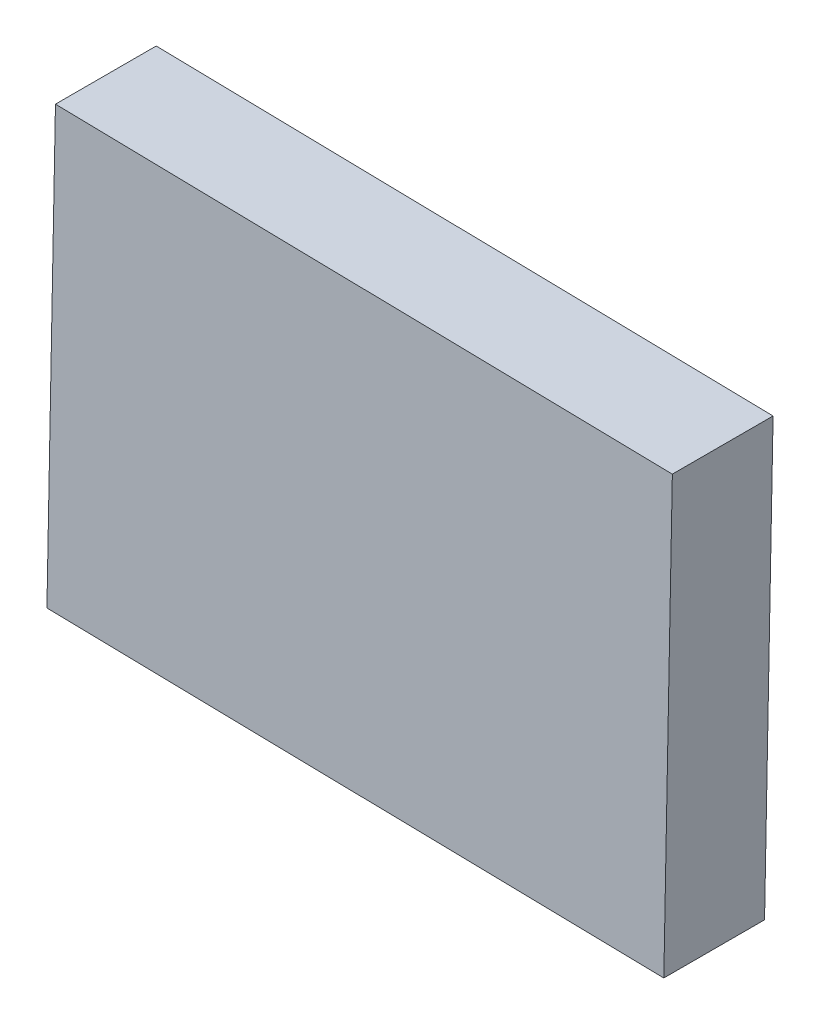
ISO-10303-21;
HEADER;
FILE_DESCRIPTION(('STEP AP214'),'2;1');
FILE_NAME('part.step','',(''),(''),'','','');
FILE_SCHEMA(('AUTOMOTIVE_DESIGN { 1 0 10303 214 1 1 1 1 }'));
ENDSEC;
DATA;
#1=APPLICATION_CONTEXT('core data for automotive mechanical design processes');
#2=APPLICATION_PROTOCOL_DEFINITION('international standard','automotive_design',2000,#1);
#3=PRODUCT_CONTEXT('',#1,'mechanical');
#4=PRODUCT('Part','Part','',(#3));
#5=PRODUCT_RELATED_PRODUCT_CATEGORY('part','',(#4));
#6=PRODUCT_DEFINITION_FORMATION('','',#4);
#7=PRODUCT_DEFINITION_CONTEXT('part definition',#1,'design');
#8=PRODUCT_DEFINITION('design','',#6,#7);
#9=PRODUCT_DEFINITION_SHAPE('','',#8);
#10=(LENGTH_UNIT() NAMED_UNIT(*) SI_UNIT(.MILLI.,.METRE.));
#11=(NAMED_UNIT(*) PLANE_ANGLE_UNIT() SI_UNIT($,.RADIAN.));
#12=(NAMED_UNIT(*) SI_UNIT($,.STERADIAN.) SOLID_ANGLE_UNIT());
#13=UNCERTAINTY_MEASURE_WITH_UNIT(LENGTH_MEASURE(1.E-05),#10,'distance_accuracy_value','');
#14=(GEOMETRIC_REPRESENTATION_CONTEXT(3) GLOBAL_UNCERTAINTY_ASSIGNED_CONTEXT((#13)) GLOBAL_UNIT_ASSIGNED_CONTEXT((#10,
#11,#12)) REPRESENTATION_CONTEXT('',''));
#15=CARTESIAN_POINT('',(0.,0.,0.));
#16=DIRECTION('',(0.,0.,1.));
#17=DIRECTION('',(1.,0.,0.));
#18=AXIS2_PLACEMENT_3D('',#15,#16,#17);
#19=CARTESIAN_POINT('',(-1.71669371262008,0.557184606220066,38.2500965279299));
#20=DIRECTION('',(0.,0.,-1.));
#21=DIRECTION('',(-0.0193548335692301,-0.999812677663925,0.));
#22=AXIS2_PLACEMENT_3D('',#19,#20,#21);
#23=PLANE('',#22);
#24=DIRECTION('',(-0.0193548335692301,-0.999812677663925,0.));
#25=VECTOR('',#24,1.);
#26=CARTESIAN_POINT('',(4.59117281569775,4.88090682913489,38.25009652793));
#27=LINE('',#26,#25);
#28=CARTESIAN_POINT('',(4.59117281569775,4.88090682913489,38.25009652793));
#29=VERTEX_POINT('',#28);
#30=CARTESIAN_POINT('',(4.4191083452673,-4.0074278752974,38.2500965279301));
#31=VERTEX_POINT('',#30);
#32=EDGE_CURVE('E73',#29,#31,#27,.T.);
#33=ORIENTED_EDGE('',*,*,#32,.T.);
#34=DIRECTION('',(-0.999812677663925,0.0193548335692301,0.));
#35=VECTOR('',#34,1.);
#36=CARTESIAN_POINT('',(4.4191083452673,-4.0074278752974,38.2500965279301));
#37=LINE('',#36,#35);
#38=CARTESIAN_POINT('',(-8.02456024093791,-3.76653761669476,38.2500965279297));
#39=VERTEX_POINT('',#38);
#40=EDGE_CURVE('E35',#31,#39,#37,.T.);
#41=ORIENTED_EDGE('',*,*,#40,.T.);
#42=DIRECTION('',(0.0193548335692301,0.999812677663925,0.));
#43=VECTOR('',#42,1.);
#44=CARTESIAN_POINT('',(-7.85249577050745,5.12179708773753,38.2500965279296));
#45=LINE('',#44,#43);
#46=CARTESIAN_POINT('',(-7.85249577050745,5.12179708773753,38.2500965279296));
#47=VERTEX_POINT('',#46);
#48=EDGE_CURVE('E70',#39,#47,#45,.T.);
#49=ORIENTED_EDGE('',*,*,#48,.T.);
#50=DIRECTION('',(0.999812677663925,-0.0193548335692301,0.));
#51=VECTOR('',#50,1.);
#52=CARTESIAN_POINT('',(4.59117281569775,4.88090682913489,38.25009652793));
#53=LINE('',#52,#51);
#54=EDGE_CURVE('E91',#47,#29,#53,.T.);
#55=ORIENTED_EDGE('',*,*,#54,.T.);
#56=EDGE_LOOP('',(#33,#41,#49,#55));
#57=FACE_BOUND('',#56,.T.);
#58=ADVANCED_FACE('F32',(#57),#23,.T.);
#59=CARTESIAN_POINT('',(4.41910834526723,-4.00742787529737,40.2820965279302));
#60=DIRECTION('',(0.0193548335692301,0.999812677663925,0.));
#61=DIRECTION('',(-0.999812677663925,0.0193548335692301,0.));
#62=AXIS2_PLACEMENT_3D('',#59,#60,#61);
#63=PLANE('',#62);
#64=DIRECTION('',(0.,0.,1.));
#65=VECTOR('',#64,1.);
#66=CARTESIAN_POINT('',(-8.02456024093798,-3.76653761669474,40.2820965279298));
#67=LINE('',#66,#65);
#68=CARTESIAN_POINT('',(-8.02456024093798,-3.76653761669474,40.2820965279298));
#69=VERTEX_POINT('',#68);
#70=EDGE_CURVE('E78',#69,#39,#67,.F.);
#71=ORIENTED_EDGE('',*,*,#70,.T.);
#72=ORIENTED_EDGE('',*,*,#40,.F.);
#73=DIRECTION('',(0.,0.,1.));
#74=VECTOR('',#73,1.);
#75=CARTESIAN_POINT('',(4.41910834526723,-4.00742787529737,40.2820965279302));
#76=LINE('',#75,#74);
#77=CARTESIAN_POINT('',(4.41910834526723,-4.00742787529737,40.2820965279302));
#78=VERTEX_POINT('',#77);
#79=EDGE_CURVE('E95',#31,#78,#76,.T.);
#80=ORIENTED_EDGE('',*,*,#79,.T.);
#81=DIRECTION('',(-0.999812677663925,0.0193548335692301,0.));
#82=VECTOR('',#81,1.);
#83=CARTESIAN_POINT('',(-1.80272594783537,-3.88698274599605,40.28209652793));
#84=LINE('',#83,#82);
#85=EDGE_CURVE('E88',#78,#69,#84,.T.);
#86=ORIENTED_EDGE('',*,*,#85,.T.);
#87=EDGE_LOOP('',(#71,#72,#80,#86));
#88=FACE_BOUND('',#87,.T.);
#89=ADVANCED_FACE('F87',(#88),#63,.F.);
#90=CARTESIAN_POINT('',(-7.85249577050752,5.12179708773756,40.2820965279296));
#91=DIRECTION('',(0.999812677663925,-0.0193548335692301,0.));
#92=DIRECTION('',(0.0193548335692301,0.999812677663925,0.));
#93=AXIS2_PLACEMENT_3D('',#90,#91,#92);
#94=PLANE('',#93);
#95=DIRECTION('',(0.,0.,1.));
#96=VECTOR('',#95,1.);
#97=CARTESIAN_POINT('',(-7.85249577050752,5.12179708773756,40.2820965279296));
#98=LINE('',#97,#96);
#99=CARTESIAN_POINT('',(-7.85249577050752,5.12179708773756,40.2820965279296));
#100=VERTEX_POINT('',#99);
#101=EDGE_CURVE('E84',#100,#47,#98,.F.);
#102=ORIENTED_EDGE('',*,*,#101,.T.);
#103=ORIENTED_EDGE('',*,*,#48,.F.);
#104=ORIENTED_EDGE('',*,*,#70,.F.);
#105=DIRECTION('',(-0.0193548335692301,-0.999812677663925,0.));
#106=VECTOR('',#105,1.);
#107=CARTESIAN_POINT('',(-7.93852800572275,0.677629735521414,40.2820965279297));
#108=LINE('',#107,#106);
#109=EDGE_CURVE('E98',#69,#100,#108,.F.);
#110=ORIENTED_EDGE('',*,*,#109,.T.);
#111=EDGE_LOOP('',(#102,#103,#104,#110));
#112=FACE_BOUND('',#111,.T.);
#113=ADVANCED_FACE('F81',(#112),#94,.F.);
#114=CARTESIAN_POINT('',(4.59117281569769,4.88090682913492,40.28209652793));
#115=DIRECTION('',(-0.0193548335692301,-0.999812677663925,0.));
#116=DIRECTION('',(0.999812677663925,-0.0193548335692301,0.));
#117=AXIS2_PLACEMENT_3D('',#114,#115,#116);
#118=PLANE('',#117);
#119=DIRECTION('',(0.,0.,1.));
#120=VECTOR('',#119,1.);
#121=CARTESIAN_POINT('',(4.59117281569769,4.88090682913492,40.28209652793));
#122=LINE('',#121,#120);
#123=CARTESIAN_POINT('',(4.59117281569769,4.88090682913492,40.28209652793));
#124=VERTEX_POINT('',#123);
#125=EDGE_CURVE('E49',#124,#29,#122,.F.);
#126=ORIENTED_EDGE('',*,*,#125,.T.);
#127=ORIENTED_EDGE('',*,*,#54,.F.);
#128=ORIENTED_EDGE('',*,*,#101,.F.);
#129=DIRECTION('',(-0.999812677663925,0.0193548335692301,0.));
#130=VECTOR('',#129,1.);
#131=CARTESIAN_POINT('',(-1.63066147740492,5.00135195843624,40.2820965279298));
#132=LINE('',#131,#130);
#133=EDGE_CURVE('E41',#100,#124,#132,.F.);
#134=ORIENTED_EDGE('',*,*,#133,.T.);
#135=EDGE_LOOP('',(#126,#127,#128,#134));
#136=FACE_BOUND('',#135,.T.);
#137=ADVANCED_FACE('F103',(#136),#118,.F.);
#138=CARTESIAN_POINT('',(4.59117281569769,4.88090682913492,40.28209652793));
#139=DIRECTION('',(-0.999812677663925,0.0193548335692301,0.));
#140=DIRECTION('',(-0.0193548335692301,-0.999812677663925,0.));
#141=AXIS2_PLACEMENT_3D('',#138,#139,#140);
#142=PLANE('',#141);
#143=ORIENTED_EDGE('',*,*,#79,.F.);
#144=ORIENTED_EDGE('',*,*,#32,.F.);
#145=ORIENTED_EDGE('',*,*,#125,.F.);
#146=DIRECTION('',(-0.0193548335692301,-0.999812677663925,0.));
#147=VECTOR('',#146,1.);
#148=CARTESIAN_POINT('',(4.50514058048246,0.436739476918776,40.2820965279301));
#149=LINE('',#148,#147);
#150=EDGE_CURVE('E11',#124,#78,#149,.T.);
#151=ORIENTED_EDGE('',*,*,#150,.T.);
#152=EDGE_LOOP('',(#143,#144,#145,#151));
#153=FACE_BOUND('',#152,.T.);
#154=ADVANCED_FACE('F106',(#153),#142,.F.);
#155=CARTESIAN_POINT('',(-1.71669371262014,0.557184606220095,40.2820965279299));
#156=DIRECTION('',(0.,0.,-1.));
#157=DIRECTION('',(-0.0193548335692301,-0.999812677663925,0.));
#158=AXIS2_PLACEMENT_3D('',#155,#156,#157);
#159=PLANE('',#158);
#160=ORIENTED_EDGE('',*,*,#133,.F.);
#161=ORIENTED_EDGE('',*,*,#109,.F.);
#162=ORIENTED_EDGE('',*,*,#85,.F.);
#163=ORIENTED_EDGE('',*,*,#150,.F.);
#164=EDGE_LOOP('',(#160,#161,#162,#163));
#165=FACE_BOUND('',#164,.T.);
#166=ADVANCED_FACE('F105',(#165),#159,.F.);
#167=CLOSED_SHELL('',(#58,#89,#113,#137,#154,#166));
#168=MANIFOLD_SOLID_BREP('B2',#167);
#169=ADVANCED_BREP_SHAPE_REPRESENTATION('',(#18,#168),#14);
#170=SHAPE_DEFINITION_REPRESENTATION(#9,#169);
ENDSEC;
END-ISO-10303-21;
